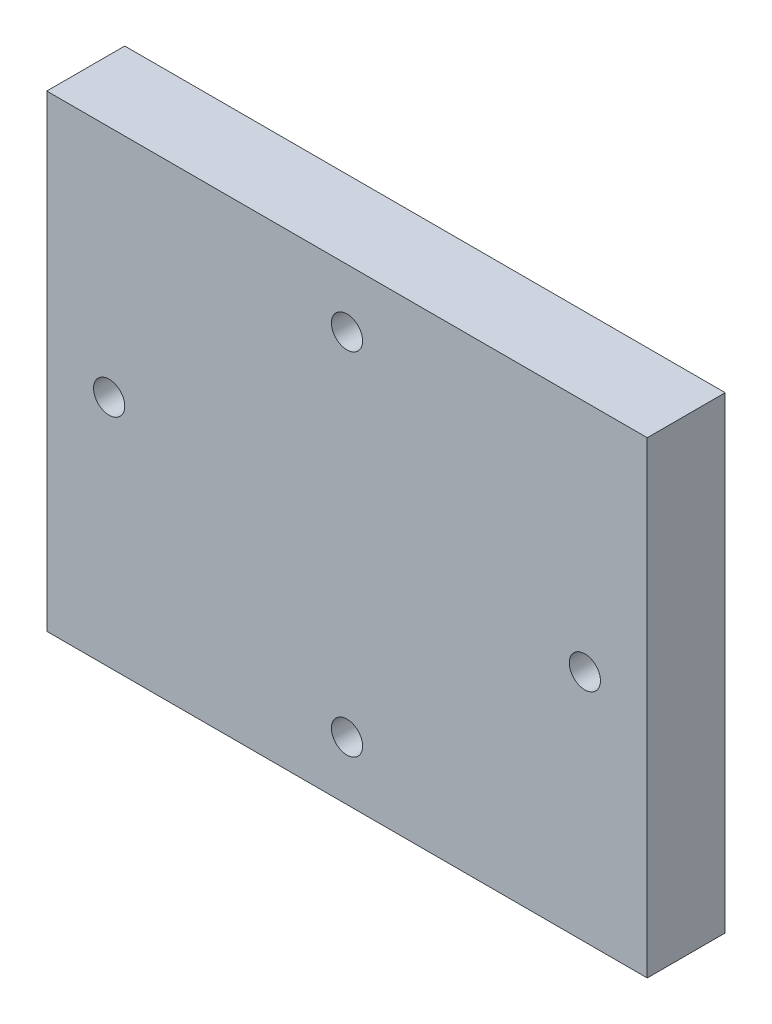
ISO-10303-21;
HEADER;
FILE_DESCRIPTION(('STEP AP214'),'2;1');
FILE_NAME('part.step','',(''),(''),'','','');
FILE_SCHEMA(('AUTOMOTIVE_DESIGN { 1 0 10303 214 1 1 1 1 }'));
ENDSEC;
DATA;
#1=APPLICATION_CONTEXT('core data for automotive mechanical design processes');
#2=APPLICATION_PROTOCOL_DEFINITION('international standard','automotive_design',2000,#1);
#3=PRODUCT_CONTEXT('',#1,'mechanical');
#4=PRODUCT('Part','Part','',(#3));
#5=PRODUCT_RELATED_PRODUCT_CATEGORY('part','',(#4));
#6=PRODUCT_DEFINITION_FORMATION('','',#4);
#7=PRODUCT_DEFINITION_CONTEXT('part definition',#1,'design');
#8=PRODUCT_DEFINITION('design','',#6,#7);
#9=PRODUCT_DEFINITION_SHAPE('','',#8);
#10=(LENGTH_UNIT() NAMED_UNIT(*) SI_UNIT(.MILLI.,.METRE.));
#11=(NAMED_UNIT(*) PLANE_ANGLE_UNIT() SI_UNIT($,.RADIAN.));
#12=(NAMED_UNIT(*) SI_UNIT($,.STERADIAN.) SOLID_ANGLE_UNIT());
#13=UNCERTAINTY_MEASURE_WITH_UNIT(LENGTH_MEASURE(1.E-05),#10,'distance_accuracy_value','');
#14=(GEOMETRIC_REPRESENTATION_CONTEXT(3) GLOBAL_UNCERTAINTY_ASSIGNED_CONTEXT((#13)) GLOBAL_UNIT_ASSIGNED_CONTEXT((#10,
#11,#12)) REPRESENTATION_CONTEXT('',''));
#15=CARTESIAN_POINT('',(0.,0.,0.));
#16=DIRECTION('',(0.,0.,1.));
#17=DIRECTION('',(1.,0.,0.));
#18=AXIS2_PLACEMENT_3D('',#15,#16,#17);
#19=CARTESIAN_POINT('',(0.,0.,10.));
#20=DIRECTION('',(0.,0.,-1.));
#21=DIRECTION('',(-1.,0.,0.));
#22=AXIS2_PLACEMENT_3D('',#19,#20,#21);
#23=PLANE('',#22);
#24=DIRECTION('',(0.,-1.,0.));
#25=VECTOR('',#24,1.);
#26=CARTESIAN_POINT('',(-30.7697412236797,-29.2302587763203,10.));
#27=LINE('',#26,#25);
#28=CARTESIAN_POINT('',(-30.7697412236797,30.7697412236797,10.));
#29=VERTEX_POINT('',#28);
#30=CARTESIAN_POINT('',(-30.7697412236797,-29.2302587763203,10.));
#31=VERTEX_POINT('',#30);
#32=EDGE_CURVE('E87',#29,#31,#27,.T.);
#33=ORIENTED_EDGE('',*,*,#32,.T.);
#34=DIRECTION('',(1.,0.,0.));
#35=VECTOR('',#34,1.);
#36=CARTESIAN_POINT('',(46.2302587763203,-29.2302587763203,10.));
#37=LINE('',#36,#35);
#38=CARTESIAN_POINT('',(46.2302587763203,-29.2302587763203,10.));
#39=VERTEX_POINT('',#38);
#40=EDGE_CURVE('E82',#31,#39,#37,.T.);
#41=ORIENTED_EDGE('',*,*,#40,.T.);
#42=DIRECTION('',(0.,1.,0.));
#43=VECTOR('',#42,1.);
#44=CARTESIAN_POINT('',(46.2302587763203,30.7697412236797,10.));
#45=LINE('',#44,#43);
#46=CARTESIAN_POINT('',(46.2302587763203,30.7697412236797,10.));
#47=VERTEX_POINT('',#46);
#48=EDGE_CURVE('E85',#39,#47,#45,.T.);
#49=ORIENTED_EDGE('',*,*,#48,.T.);
#50=DIRECTION('',(-1.,0.,0.));
#51=VECTOR('',#50,1.);
#52=CARTESIAN_POINT('',(-30.7697412236797,30.7697412236797,10.));
#53=LINE('',#52,#51);
#54=EDGE_CURVE('E52',#47,#29,#53,.T.);
#55=ORIENTED_EDGE('',*,*,#54,.T.);
#56=EDGE_LOOP('',(#33,#41,#49,#55));
#57=FACE_BOUND('',#56,.T.);
#58=CARTESIAN_POINT('',(7.7302587763203,23.2697412236797,10.));
#59=DIRECTION('',(0.,0.,1.));
#60=DIRECTION('',(1.,0.,0.));
#61=AXIS2_PLACEMENT_3D('',#58,#59,#60);
#62=CIRCLE('',#61,2.);
#63=CARTESIAN_POINT('',(9.7302587763203,23.2697412236797,10.));
#64=VERTEX_POINT('',#63);
#65=EDGE_CURVE('E102',#64,#64,#62,.T.);
#66=ORIENTED_EDGE('',*,*,#65,.F.);
#67=EDGE_LOOP('',(#66));
#68=FACE_BOUND('',#67,.T.);
#69=CARTESIAN_POINT('',(7.7302587763203,-21.7302587763203,10.));
#70=DIRECTION('',(0.,0.,1.));
#71=DIRECTION('',(-1.,0.,0.));
#72=AXIS2_PLACEMENT_3D('',#69,#70,#71);
#73=CIRCLE('',#72,2.);
#74=CARTESIAN_POINT('',(5.7302587763203,-21.7302587763203,10.));
#75=VERTEX_POINT('',#74);
#76=EDGE_CURVE('E117',#75,#75,#73,.T.);
#77=ORIENTED_EDGE('',*,*,#76,.F.);
#78=EDGE_LOOP('',(#77));
#79=FACE_BOUND('',#78,.T.);
#80=CARTESIAN_POINT('',(38.2302587763203,0.769741223679676,10.));
#81=DIRECTION('',(0.,0.,1.));
#82=DIRECTION('',(1.,0.,0.));
#83=AXIS2_PLACEMENT_3D('',#80,#81,#82);
#84=CIRCLE('',#83,2.);
#85=CARTESIAN_POINT('',(40.2302587763203,0.769741223679676,10.));
#86=VERTEX_POINT('',#85);
#87=EDGE_CURVE('E123',#86,#86,#84,.T.);
#88=ORIENTED_EDGE('',*,*,#87,.F.);
#89=EDGE_LOOP('',(#88));
#90=FACE_BOUND('',#89,.T.);
#91=CARTESIAN_POINT('',(-22.7697412236797,0.76974122367967,10.));
#92=DIRECTION('',(0.,0.,1.));
#93=DIRECTION('',(1.,0.,0.));
#94=AXIS2_PLACEMENT_3D('',#91,#92,#93);
#95=CIRCLE('',#94,2.);
#96=CARTESIAN_POINT('',(-20.7697412236797,0.76974122367967,10.));
#97=VERTEX_POINT('',#96);
#98=EDGE_CURVE('E129',#97,#97,#95,.T.);
#99=ORIENTED_EDGE('',*,*,#98,.F.);
#100=EDGE_LOOP('',(#99));
#101=FACE_BOUND('',#100,.T.);
#102=ADVANCED_FACE('F35',(#57,#68,#79,#90,#101),#23,.F.);
#103=CARTESIAN_POINT('',(0.,0.,0.));
#104=DIRECTION('',(0.,0.,-1.));
#105=DIRECTION('',(-1.,0.,0.));
#106=AXIS2_PLACEMENT_3D('',#103,#104,#105);
#107=PLANE('',#106);
#108=CARTESIAN_POINT('',(38.2302587763203,0.769741223679676,0.));
#109=DIRECTION('',(0.,0.,1.));
#110=DIRECTION('',(1.,0.,0.));
#111=AXIS2_PLACEMENT_3D('',#108,#109,#110);
#112=CIRCLE('',#111,2.);
#113=CARTESIAN_POINT('',(40.2302587763203,0.769741223679676,0.));
#114=VERTEX_POINT('',#113);
#115=EDGE_CURVE('E126',#114,#114,#112,.T.);
#116=ORIENTED_EDGE('',*,*,#115,.T.);
#117=EDGE_LOOP('',(#116));
#118=FACE_BOUND('',#117,.T.);
#119=CARTESIAN_POINT('',(7.7302587763203,23.2697412236797,0.));
#120=DIRECTION('',(0.,0.,1.));
#121=DIRECTION('',(1.,0.,0.));
#122=AXIS2_PLACEMENT_3D('',#119,#120,#121);
#123=CIRCLE('',#122,2.);
#124=CARTESIAN_POINT('',(9.7302587763203,23.2697412236797,0.));
#125=VERTEX_POINT('',#124);
#126=EDGE_CURVE('E114',#125,#125,#123,.T.);
#127=ORIENTED_EDGE('',*,*,#126,.T.);
#128=EDGE_LOOP('',(#127));
#129=FACE_BOUND('',#128,.T.);
#130=DIRECTION('',(0.,-1.,0.));
#131=VECTOR('',#130,1.);
#132=CARTESIAN_POINT('',(-30.7697412236797,-29.2302587763203,0.));
#133=LINE('',#132,#131);
#134=CARTESIAN_POINT('',(-30.7697412236797,30.7697412236797,0.));
#135=VERTEX_POINT('',#134);
#136=CARTESIAN_POINT('',(-30.7697412236797,-29.2302587763203,0.));
#137=VERTEX_POINT('',#136);
#138=EDGE_CURVE('E99',#135,#137,#133,.T.);
#139=ORIENTED_EDGE('',*,*,#138,.F.);
#140=DIRECTION('',(-1.,0.,0.));
#141=VECTOR('',#140,1.);
#142=CARTESIAN_POINT('',(-30.7697412236797,30.7697412236797,0.));
#143=LINE('',#142,#141);
#144=CARTESIAN_POINT('',(46.2302587763203,30.7697412236797,0.));
#145=VERTEX_POINT('',#144);
#146=EDGE_CURVE('E75',#145,#135,#143,.T.);
#147=ORIENTED_EDGE('',*,*,#146,.F.);
#148=DIRECTION('',(0.,1.,0.));
#149=VECTOR('',#148,1.);
#150=CARTESIAN_POINT('',(46.2302587763203,30.7697412236797,0.));
#151=LINE('',#150,#149);
#152=CARTESIAN_POINT('',(46.2302587763203,-29.2302587763203,0.));
#153=VERTEX_POINT('',#152);
#154=EDGE_CURVE('E69',#153,#145,#151,.T.);
#155=ORIENTED_EDGE('',*,*,#154,.F.);
#156=DIRECTION('',(1.,0.,0.));
#157=VECTOR('',#156,1.);
#158=CARTESIAN_POINT('',(46.2302587763203,-29.2302587763203,0.));
#159=LINE('',#158,#157);
#160=EDGE_CURVE('E91',#137,#153,#159,.T.);
#161=ORIENTED_EDGE('',*,*,#160,.F.);
#162=EDGE_LOOP('',(#139,#147,#155,#161));
#163=FACE_BOUND('',#162,.T.);
#164=CARTESIAN_POINT('',(7.7302587763203,-21.7302587763203,0.));
#165=DIRECTION('',(0.,0.,1.));
#166=DIRECTION('',(-1.,0.,0.));
#167=AXIS2_PLACEMENT_3D('',#164,#165,#166);
#168=CIRCLE('',#167,2.);
#169=CARTESIAN_POINT('',(5.7302587763203,-21.7302587763203,0.));
#170=VERTEX_POINT('',#169);
#171=EDGE_CURVE('E120',#170,#170,#168,.T.);
#172=ORIENTED_EDGE('',*,*,#171,.T.);
#173=EDGE_LOOP('',(#172));
#174=FACE_BOUND('',#173,.T.);
#175=CARTESIAN_POINT('',(-22.7697412236797,0.76974122367967,0.));
#176=DIRECTION('',(0.,0.,1.));
#177=DIRECTION('',(1.,0.,0.));
#178=AXIS2_PLACEMENT_3D('',#175,#176,#177);
#179=CIRCLE('',#178,2.);
#180=CARTESIAN_POINT('',(-20.7697412236797,0.76974122367967,0.));
#181=VERTEX_POINT('',#180);
#182=EDGE_CURVE('E132',#181,#181,#179,.T.);
#183=ORIENTED_EDGE('',*,*,#182,.T.);
#184=EDGE_LOOP('',(#183));
#185=FACE_BOUND('',#184,.T.);
#186=ADVANCED_FACE('F110',(#118,#129,#163,#174,#185),#107,.T.);
#187=CARTESIAN_POINT('',(-30.7697412236797,-29.2302587763203,10.));
#188=DIRECTION('',(1.,0.,0.));
#189=DIRECTION('',(0.,1.,0.));
#190=AXIS2_PLACEMENT_3D('',#187,#188,#189);
#191=PLANE('',#190);
#192=ORIENTED_EDGE('',*,*,#138,.T.);
#193=DIRECTION('',(0.,0.,-1.));
#194=VECTOR('',#193,1.);
#195=CARTESIAN_POINT('',(-30.7697412236797,-29.2302587763203,10.));
#196=LINE('',#195,#194);
#197=EDGE_CURVE('E11',#31,#137,#196,.T.);
#198=ORIENTED_EDGE('',*,*,#197,.F.);
#199=ORIENTED_EDGE('',*,*,#32,.F.);
#200=DIRECTION('',(0.,0.,-1.));
#201=VECTOR('',#200,1.);
#202=CARTESIAN_POINT('',(-30.7697412236797,30.7697412236797,10.));
#203=LINE('',#202,#201);
#204=EDGE_CURVE('E95',#29,#135,#203,.T.);
#205=ORIENTED_EDGE('',*,*,#204,.T.);
#206=EDGE_LOOP('',(#192,#198,#199,#205));
#207=FACE_BOUND('',#206,.T.);
#208=ADVANCED_FACE('F37',(#207),#191,.F.);
#209=CARTESIAN_POINT('',(46.2302587763203,-29.2302587763203,10.));
#210=DIRECTION('',(0.,1.,0.));
#211=DIRECTION('',(-1.,0.,0.));
#212=AXIS2_PLACEMENT_3D('',#209,#210,#211);
#213=PLANE('',#212);
#214=ORIENTED_EDGE('',*,*,#160,.T.);
#215=DIRECTION('',(0.,0.,-1.));
#216=VECTOR('',#215,1.);
#217=CARTESIAN_POINT('',(46.2302587763203,-29.2302587763203,10.));
#218=LINE('',#217,#216);
#219=EDGE_CURVE('E44',#39,#153,#218,.T.);
#220=ORIENTED_EDGE('',*,*,#219,.F.);
#221=ORIENTED_EDGE('',*,*,#40,.F.);
#222=ORIENTED_EDGE('',*,*,#197,.T.);
#223=EDGE_LOOP('',(#214,#220,#221,#222));
#224=FACE_BOUND('',#223,.T.);
#225=ADVANCED_FACE('F90',(#224),#213,.F.);
#226=CARTESIAN_POINT('',(46.2302587763203,30.7697412236797,10.));
#227=DIRECTION('',(-1.,0.,0.));
#228=DIRECTION('',(0.,-1.,0.));
#229=AXIS2_PLACEMENT_3D('',#226,#227,#228);
#230=PLANE('',#229);
#231=ORIENTED_EDGE('',*,*,#154,.T.);
#232=DIRECTION('',(0.,0.,-1.));
#233=VECTOR('',#232,1.);
#234=CARTESIAN_POINT('',(46.2302587763203,30.7697412236797,10.));
#235=LINE('',#234,#233);
#236=EDGE_CURVE('E92',#47,#145,#235,.T.);
#237=ORIENTED_EDGE('',*,*,#236,.F.);
#238=ORIENTED_EDGE('',*,*,#48,.F.);
#239=ORIENTED_EDGE('',*,*,#219,.T.);
#240=EDGE_LOOP('',(#231,#237,#238,#239));
#241=FACE_BOUND('',#240,.T.);
#242=ADVANCED_FACE('F93',(#241),#230,.F.);
#243=CARTESIAN_POINT('',(-30.7697412236797,30.7697412236797,10.));
#244=DIRECTION('',(0.,-1.,0.));
#245=DIRECTION('',(0.,0.,-1.));
#246=AXIS2_PLACEMENT_3D('',#243,#244,#245);
#247=PLANE('',#246);
#248=ORIENTED_EDGE('',*,*,#146,.T.);
#249=ORIENTED_EDGE('',*,*,#204,.F.);
#250=ORIENTED_EDGE('',*,*,#54,.F.);
#251=ORIENTED_EDGE('',*,*,#236,.T.);
#252=EDGE_LOOP('',(#248,#249,#250,#251));
#253=FACE_BOUND('',#252,.T.);
#254=ADVANCED_FACE('F107',(#253),#247,.F.);
#255=CARTESIAN_POINT('',(7.7302587763203,23.2697412236797,10.));
#256=DIRECTION('',(0.,0.,-1.));
#257=DIRECTION('',(-1.,0.,0.));
#258=AXIS2_PLACEMENT_3D('',#255,#256,#257);
#259=CYLINDRICAL_SURFACE('',#258,2.);
#260=ORIENTED_EDGE('',*,*,#65,.T.);
#261=EDGE_LOOP('',(#260));
#262=FACE_BOUND('',#261,.T.);
#263=ORIENTED_EDGE('',*,*,#126,.F.);
#264=EDGE_LOOP('',(#263));
#265=FACE_BOUND('',#264,.T.);
#266=ADVANCED_FACE('F149',(#262,#265),#259,.F.);
#267=CARTESIAN_POINT('',(7.7302587763203,-21.7302587763203,10.));
#268=DIRECTION('',(0.,0.,-1.));
#269=DIRECTION('',(-1.,0.,0.));
#270=AXIS2_PLACEMENT_3D('',#267,#268,#269);
#271=CYLINDRICAL_SURFACE('',#270,2.);
#272=ORIENTED_EDGE('',*,*,#76,.T.);
#273=EDGE_LOOP('',(#272));
#274=FACE_BOUND('',#273,.T.);
#275=ORIENTED_EDGE('',*,*,#171,.F.);
#276=EDGE_LOOP('',(#275));
#277=FACE_BOUND('',#276,.T.);
#278=ADVANCED_FACE('F195',(#274,#277),#271,.F.);
#279=CARTESIAN_POINT('',(38.2302587763203,0.769741223679676,10.));
#280=DIRECTION('',(0.,0.,-1.));
#281=DIRECTION('',(-1.,0.,0.));
#282=AXIS2_PLACEMENT_3D('',#279,#280,#281);
#283=CYLINDRICAL_SURFACE('',#282,2.);
#284=ORIENTED_EDGE('',*,*,#87,.T.);
#285=EDGE_LOOP('',(#284));
#286=FACE_BOUND('',#285,.T.);
#287=ORIENTED_EDGE('',*,*,#115,.F.);
#288=EDGE_LOOP('',(#287));
#289=FACE_BOUND('',#288,.T.);
#290=ADVANCED_FACE('F203',(#286,#289),#283,.F.);
#291=CARTESIAN_POINT('',(-22.7697412236797,0.76974122367967,10.));
#292=DIRECTION('',(0.,0.,-1.));
#293=DIRECTION('',(-1.,0.,0.));
#294=AXIS2_PLACEMENT_3D('',#291,#292,#293);
#295=CYLINDRICAL_SURFACE('',#294,2.);
#296=ORIENTED_EDGE('',*,*,#98,.T.);
#297=EDGE_LOOP('',(#296));
#298=FACE_BOUND('',#297,.T.);
#299=ORIENTED_EDGE('',*,*,#182,.F.);
#300=EDGE_LOOP('',(#299));
#301=FACE_BOUND('',#300,.T.);
#302=ADVANCED_FACE('F138',(#298,#301),#295,.F.);
#303=CLOSED_SHELL('',(#102,#186,#208,#225,#242,#254,#266,#278,#290,#302));
#304=MANIFOLD_SOLID_BREP('B2',#303);
#305=ADVANCED_BREP_SHAPE_REPRESENTATION('',(#18,#304),#14);
#306=SHAPE_DEFINITION_REPRESENTATION(#9,#305);
ENDSEC;
END-ISO-10303-21;
